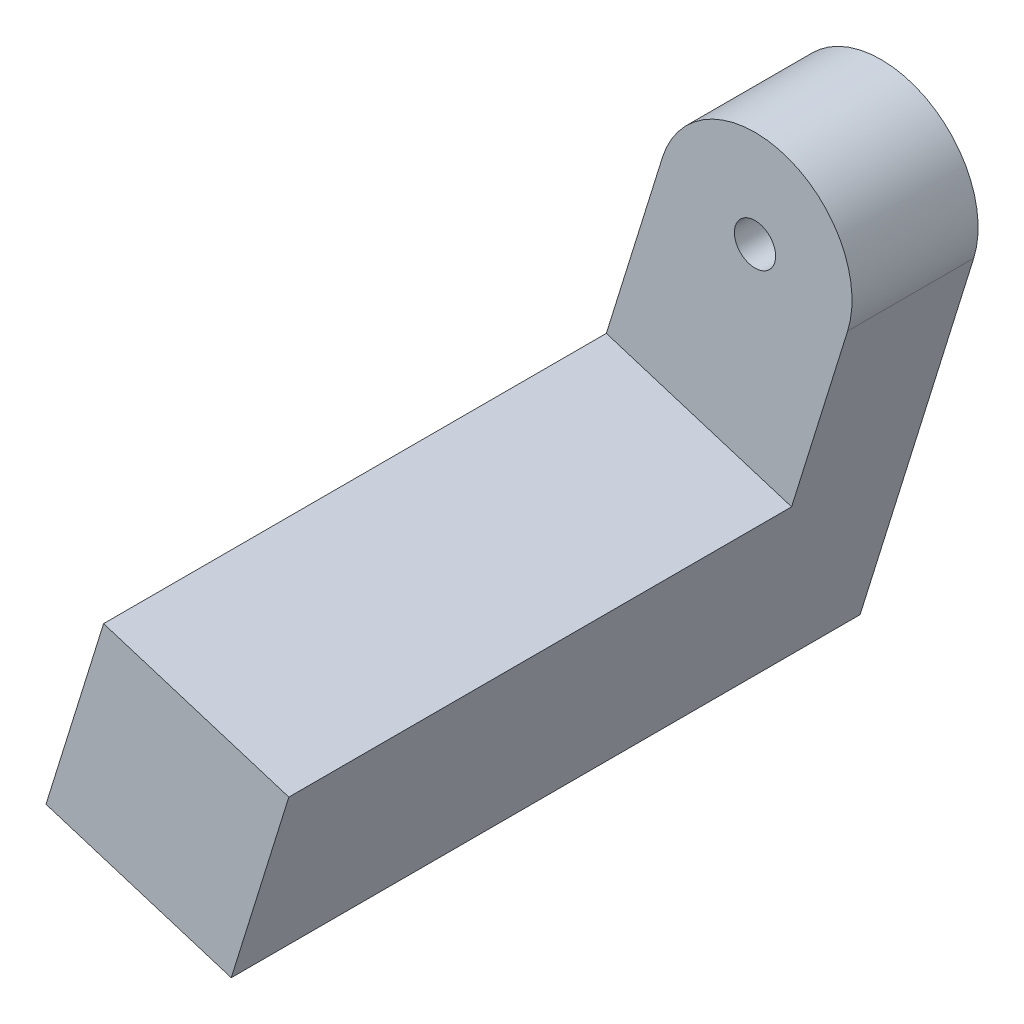
ISO-10303-21;
HEADER;
FILE_DESCRIPTION(('STEP AP214'),'2;1');
FILE_NAME('part.step','',(''),(''),'','','');
FILE_SCHEMA(('AUTOMOTIVE_DESIGN { 1 0 10303 214 1 1 1 1 }'));
ENDSEC;
DATA;
#1=APPLICATION_CONTEXT('core data for automotive mechanical design processes');
#2=APPLICATION_PROTOCOL_DEFINITION('international standard','automotive_design',2000,#1);
#3=PRODUCT_CONTEXT('',#1,'mechanical');
#4=PRODUCT('Part','Part','',(#3));
#5=PRODUCT_RELATED_PRODUCT_CATEGORY('part','',(#4));
#6=PRODUCT_DEFINITION_FORMATION('','',#4);
#7=PRODUCT_DEFINITION_CONTEXT('part definition',#1,'design');
#8=PRODUCT_DEFINITION('design','',#6,#7);
#9=PRODUCT_DEFINITION_SHAPE('','',#8);
#10=(LENGTH_UNIT() NAMED_UNIT(*) SI_UNIT(.MILLI.,.METRE.));
#11=(NAMED_UNIT(*) PLANE_ANGLE_UNIT() SI_UNIT($,.RADIAN.));
#12=(NAMED_UNIT(*) SI_UNIT($,.STERADIAN.) SOLID_ANGLE_UNIT());
#13=UNCERTAINTY_MEASURE_WITH_UNIT(LENGTH_MEASURE(1.E-05),#10,'distance_accuracy_value','');
#14=(GEOMETRIC_REPRESENTATION_CONTEXT(3) GLOBAL_UNCERTAINTY_ASSIGNED_CONTEXT((#13)) GLOBAL_UNIT_ASSIGNED_CONTEXT((#10,
#11,#12)) REPRESENTATION_CONTEXT('',''));
#15=CARTESIAN_POINT('',(0.,0.,0.));
#16=DIRECTION('',(0.,0.,1.));
#17=DIRECTION('',(1.,0.,0.));
#18=AXIS2_PLACEMENT_3D('',#15,#16,#17);
#19=CARTESIAN_POINT('',(-3.81965194648471,1.18754326561838,2.));
#20=DIRECTION('',(0.296885816404479,0.954912986621214,0.));
#21=DIRECTION('',(-0.954912986621214,0.296885816404479,0.));
#22=AXIS2_PLACEMENT_3D('',#19,#20,#21);
#23=PLANE('',#22);
#24=DIRECTION('',(0.,0.,1.));
#25=VECTOR('',#24,1.);
#26=CARTESIAN_POINT('',(-0.811676038627886,0.252352943944275,-3.19999999999843));
#27=LINE('',#26,#25);
#28=CARTESIAN_POINT('',(-0.811676038627886,0.252352943944275,-3.19999999999843));
#29=VERTEX_POINT('',#28);
#30=CARTESIAN_POINT('',(-0.811676038627886,0.252352943944275,0.));
#31=VERTEX_POINT('',#30);
#32=EDGE_CURVE('E11',#29,#31,#27,.T.);
#33=ORIENTED_EDGE('',*,*,#32,.F.);
#34=DIRECTION('',(0.954912986621214,-0.296885816404479,0.));
#35=VECTOR('',#34,1.);
#36=CARTESIAN_POINT('',(-3.81965194648471,1.18754326561838,-3.19999999999755));
#37=LINE('',#36,#35);
#38=CARTESIAN_POINT('',(-2.19629986920415,0.68283737772315,-3.19999999999804));
#39=VERTEX_POINT('',#38);
#40=EDGE_CURVE('E126',#39,#29,#37,.T.);
#41=ORIENTED_EDGE('',*,*,#40,.F.);
#42=DIRECTION('',(0.,0.,1.));
#43=VECTOR('',#42,1.);
#44=CARTESIAN_POINT('',(-2.19629986922865,0.682837377730769,-14.5137084989829));
#45=LINE('',#44,#43);
#46=CARTESIAN_POINT('',(-2.19629986922879,0.6828373777303,0.));
#47=VERTEX_POINT('',#46);
#48=EDGE_CURVE('E61',#47,#39,#45,.F.);
#49=ORIENTED_EDGE('',*,*,#48,.F.);
#50=DIRECTION('',(-0.954912986621214,0.296885816404479,0.));
#51=VECTOR('',#50,1.);
#52=CARTESIAN_POINT('',(0.,0.,0.));
#53=LINE('',#52,#51);
#54=EDGE_CURVE('E127',#31,#47,#53,.T.);
#55=ORIENTED_EDGE('',*,*,#54,.F.);
#56=EDGE_LOOP('',(#33,#41,#49,#55));
#57=FACE_BOUND('',#56,.T.);
#58=ADVANCED_FACE('F39',(#57),#23,.T.);
#59=CARTESIAN_POINT('',(0.,0.,-14.5137084989829));
#60=DIRECTION('',(0.,0.,1.));
#61=DIRECTION('',(1.,0.,0.));
#62=AXIS2_PLACEMENT_3D('',#59,#60,#61);
#63=CYLINDRICAL_SURFACE('',#62,4.);
#64=DIRECTION('',(0.,0.,1.));
#65=VECTOR('',#64,1.);
#66=CARTESIAN_POINT('',(-3.81965194648471,1.18754326561838,2.));
#67=LINE('',#66,#65);
#68=CARTESIAN_POINT('',(-3.81965194648471,1.18754326561838,-3.19999999999755));
#69=VERTEX_POINT('',#68);
#70=CARTESIAN_POINT('',(-3.81965194648471,1.18754326561838,2.));
#71=VERTEX_POINT('',#70);
#72=EDGE_CURVE('E145',#69,#71,#67,.T.);
#73=ORIENTED_EDGE('',*,*,#72,.T.);
#74=CARTESIAN_POINT('',(0.,0.,2.));
#75=DIRECTION('',(0.,0.,1.));
#76=DIRECTION('',(1.,0.,0.));
#77=AXIS2_PLACEMENT_3D('',#74,#75,#76);
#78=CIRCLE('',#77,4.);
#79=CARTESIAN_POINT('',(3.819651946485,-1.18754326561745,2.));
#80=VERTEX_POINT('',#79);
#81=EDGE_CURVE('E154',#80,#71,#78,.T.);
#82=ORIENTED_EDGE('',*,*,#81,.F.);
#83=DIRECTION('',(0.,0.,1.));
#84=VECTOR('',#83,1.);
#85=CARTESIAN_POINT('',(3.819651946485,-1.18754326561745,2.));
#86=LINE('',#85,#84);
#87=CARTESIAN_POINT('',(3.81965194648486,-1.18754326561791,-3.19999999999843));
#88=VERTEX_POINT('',#87);
#89=EDGE_CURVE('E137',#88,#80,#86,.T.);
#90=ORIENTED_EDGE('',*,*,#89,.F.);
#91=CARTESIAN_POINT('',(0.,0.,-3.19999999999819));
#92=DIRECTION('',(1.0538286023532E-13,1.33842857646129E-13,1.));
#93=DIRECTION('',(0.,-1.,1.33842857646129E-13));
#94=AXIS2_PLACEMENT_3D('',#91,#92,#93);
#95=CIRCLE('',#94,4.);
#96=EDGE_CURVE('E161',#69,#88,#95,.F.);
#97=ORIENTED_EDGE('',*,*,#96,.F.);
#98=EDGE_LOOP('',(#73,#82,#90,#97));
#99=FACE_BOUND('',#98,.T.);
#100=ADVANCED_FACE('F41',(#99),#63,.T.);
#101=CARTESIAN_POINT('',(0.,0.,-14.5137084989829));
#102=DIRECTION('',(0.,0.,1.));
#103=DIRECTION('',(1.,0.,0.));
#104=AXIS2_PLACEMENT_3D('',#101,#102,#103);
#105=CYLINDRICAL_SURFACE('',#104,2.3);
#106=CARTESIAN_POINT('',(0.,0.,0.));
#107=DIRECTION('',(0.,0.,1.));
#108=DIRECTION('',(1.,0.,0.));
#109=AXIS2_PLACEMENT_3D('',#106,#107,#108);
#110=CIRCLE('',#109,2.3);
#111=CARTESIAN_POINT('',(2.19629986922879,-0.6828373777303,0.));
#112=VERTEX_POINT('',#111);
#113=EDGE_CURVE('E158',#112,#47,#110,.T.);
#114=ORIENTED_EDGE('',*,*,#113,.T.);
#115=ORIENTED_EDGE('',*,*,#48,.T.);
#116=CARTESIAN_POINT('',(4.53526105559376E-11,5.94515756069391E-11,-3.19999999999818));
#117=DIRECTION('',(1.0538286023532E-13,1.33842857646129E-13,1.));
#118=DIRECTION('',(-0.954912986621214,0.296885816404478,0.));
#119=AXIS2_PLACEMENT_3D('',#116,#117,#118);
#120=CIRCLE('',#119,2.3);
#121=CARTESIAN_POINT('',(2.19629986925344,-0.682837377737451,-3.19999999999832));
#122=VERTEX_POINT('',#121);
#123=EDGE_CURVE('E130',#122,#39,#120,.T.);
#124=ORIENTED_EDGE('',*,*,#123,.F.);
#125=DIRECTION('',(0.,0.,1.));
#126=VECTOR('',#125,1.);
#127=CARTESIAN_POINT('',(2.19629986922894,-0.682837377729831,-14.5137084989829));
#128=LINE('',#127,#126);
#129=EDGE_CURVE('E148',#122,#112,#128,.T.);
#130=ORIENTED_EDGE('',*,*,#129,.T.);
#131=EDGE_LOOP('',(#114,#115,#124,#130));
#132=FACE_BOUND('',#131,.T.);
#133=ADVANCED_FACE('F165',(#132),#105,.F.);
#134=CARTESIAN_POINT('',(-2.61259518431406,-8.40323428220723,-3.19999999999679));
#135=DIRECTION('',(1.0538286023532E-13,1.33842857646129E-13,1.));
#136=DIRECTION('',(-0.954912986621214,0.296885816404478,0.));
#137=AXIS2_PLACEMENT_3D('',#134,#135,#136);
#138=PLANE('',#137);
#139=ORIENTED_EDGE('',*,*,#40,.T.);
#140=CARTESIAN_POINT('',(0.,0.,-3.19999999999843));
#141=DIRECTION('',(0.,0.,1.));
#142=DIRECTION('',(1.,0.,0.));
#143=AXIS2_PLACEMENT_3D('',#140,#141,#142);
#144=CIRCLE('',#143,0.85);
#145=CARTESIAN_POINT('',(0.811676038628177,-0.252352943943339,-3.19999999999843));
#146=VERTEX_POINT('',#145);
#147=EDGE_CURVE('E115',#29,#146,#144,.T.);
#148=ORIENTED_EDGE('',*,*,#147,.T.);
#149=EDGE_CURVE('E54',#146,#122,#37,.T.);
#150=ORIENTED_EDGE('',*,*,#149,.T.);
#151=ORIENTED_EDGE('',*,*,#123,.T.);
#152=EDGE_LOOP('',(#139,#148,#150,#151));
#153=FACE_BOUND('',#152,.T.);
#154=ORIENTED_EDGE('',*,*,#96,.T.);
#155=DIRECTION('',(0.296885816404479,0.954912986621214,0.));
#156=VECTOR('',#155,1.);
#157=CARTESIAN_POINT('',(3.819651946485,-1.18754326561745,-3.19999999999755));
#158=LINE('',#157,#156);
#159=CARTESIAN_POINT('',(-0.866666154954968,-16.260765923066,-3.19999999999755));
#160=VERTEX_POINT('',#159);
#161=EDGE_CURVE('E217',#160,#88,#158,.T.);
#162=ORIENTED_EDGE('',*,*,#161,.F.);
#163=DIRECTION('',(0.954912986621214,-0.296885816404479,0.));
#164=VECTOR('',#163,1.);
#165=CARTESIAN_POINT('',(-8.50597004792468,-13.8856793918302,-3.19999999999755));
#166=LINE('',#165,#164);
#167=CARTESIAN_POINT('',(-8.50597004792468,-13.8856793918302,-3.19999999999755));
#168=VERTEX_POINT('',#167);
#169=EDGE_CURVE('E134',#168,#160,#166,.T.);
#170=ORIENTED_EDGE('',*,*,#169,.F.);
#171=DIRECTION('',(0.296885816404479,0.954912986621214,0.));
#172=VECTOR('',#171,1.);
#173=CARTESIAN_POINT('',(-3.81965194648471,1.18754326561838,-3.19999999999755));
#174=LINE('',#173,#172);
#175=EDGE_CURVE('E202',#168,#69,#174,.T.);
#176=ORIENTED_EDGE('',*,*,#175,.T.);
#177=EDGE_LOOP('',(#154,#162,#170,#176));
#178=FACE_BOUND('',#177,.T.);
#179=ADVANCED_FACE('F128',(#153,#178),#138,.F.);
#180=CARTESIAN_POINT('',(0.,0.,0.));
#181=DIRECTION('',(0.,0.,1.));
#182=DIRECTION('',(1.,0.,0.));
#183=AXIS2_PLACEMENT_3D('',#180,#181,#182);
#184=PLANE('',#183);
#185=ORIENTED_EDGE('',*,*,#113,.F.);
#186=CARTESIAN_POINT('',(0.811676038628177,-0.252352943943339,0.));
#187=VERTEX_POINT('',#186);
#188=EDGE_CURVE('E133',#112,#187,#53,.T.);
#189=ORIENTED_EDGE('',*,*,#188,.T.);
#190=CARTESIAN_POINT('',(0.,0.,0.));
#191=DIRECTION('',(0.,0.,1.));
#192=DIRECTION('',(1.,0.,0.));
#193=AXIS2_PLACEMENT_3D('',#190,#191,#192);
#194=CIRCLE('',#193,0.85);
#195=EDGE_CURVE('E150',#187,#31,#194,.T.);
#196=ORIENTED_EDGE('',*,*,#195,.T.);
#197=ORIENTED_EDGE('',*,*,#54,.T.);
#198=EDGE_LOOP('',(#185,#189,#196,#197));
#199=FACE_BOUND('',#198,.T.);
#200=ADVANCED_FACE('F170',(#199),#184,.F.);
#201=CARTESIAN_POINT('',(0.,0.,2.));
#202=DIRECTION('',(0.,0.,1.));
#203=DIRECTION('',(1.,0.,0.));
#204=AXIS2_PLACEMENT_3D('',#201,#202,#203);
#205=PLANE('',#204);
#206=CARTESIAN_POINT('',(0.,0.,2.));
#207=DIRECTION('',(0.,0.,1.));
#208=DIRECTION('',(1.,0.,0.));
#209=AXIS2_PLACEMENT_3D('',#206,#207,#208);
#210=CIRCLE('',#209,0.85);
#211=CARTESIAN_POINT('',(0.85,0.,2.));
#212=VERTEX_POINT('',#211);
#213=EDGE_CURVE('E151',#212,#212,#210,.T.);
#214=ORIENTED_EDGE('',*,*,#213,.F.);
#215=EDGE_LOOP('',(#214));
#216=FACE_BOUND('',#215,.T.);
#217=ORIENTED_EDGE('',*,*,#81,.T.);
#218=DIRECTION('',(-0.296885816404479,-0.954912986621214,0.));
#219=VECTOR('',#218,1.);
#220=CARTESIAN_POINT('',(-3.81965194648471,1.18754326561838,2.));
#221=LINE('',#220,#219);
#222=CARTESIAN_POINT('',(-6.13088351668885,-6.24637549886046,2.));
#223=VERTEX_POINT('',#222);
#224=EDGE_CURVE('E206',#71,#223,#221,.T.);
#225=ORIENTED_EDGE('',*,*,#224,.T.);
#226=DIRECTION('',(0.954912986621214,-0.296885816404479,0.));
#227=VECTOR('',#226,1.);
#228=CARTESIAN_POINT('',(-6.13088351668885,-6.24637549886046,2.));
#229=LINE('',#228,#227);
#230=CARTESIAN_POINT('',(1.50842037628086,-8.62146203009629,2.));
#231=VERTEX_POINT('',#230);
#232=EDGE_CURVE('E144',#223,#231,#229,.T.);
#233=ORIENTED_EDGE('',*,*,#232,.T.);
#234=DIRECTION('',(-0.296885816404479,-0.954912986621214,0.));
#235=VECTOR('',#234,1.);
#236=CARTESIAN_POINT('',(3.819651946485,-1.18754326561745,2.));
#237=LINE('',#236,#235);
#238=EDGE_CURVE('E121',#80,#231,#237,.T.);
#239=ORIENTED_EDGE('',*,*,#238,.F.);
#240=EDGE_LOOP('',(#217,#225,#233,#239));
#241=FACE_BOUND('',#240,.T.);
#242=ADVANCED_FACE('F183',(#216,#241),#205,.T.);
#243=CARTESIAN_POINT('',(0.,0.,2.));
#244=DIRECTION('',(0.,0.,-1.));
#245=DIRECTION('',(-1.,0.,0.));
#246=AXIS2_PLACEMENT_3D('',#243,#244,#245);
#247=CYLINDRICAL_SURFACE('',#246,0.85);
#248=ORIENTED_EDGE('',*,*,#213,.T.);
#249=EDGE_LOOP('',(#248));
#250=FACE_BOUND('',#249,.T.);
#251=ORIENTED_EDGE('',*,*,#195,.F.);
#252=DIRECTION('',(0.,0.,1.));
#253=VECTOR('',#252,1.);
#254=CARTESIAN_POINT('',(0.811676038628177,-0.252352943943339,-3.19999999999843));
#255=LINE('',#254,#253);
#256=EDGE_CURVE('E47',#187,#146,#255,.F.);
#257=ORIENTED_EDGE('',*,*,#256,.T.);
#258=ORIENTED_EDGE('',*,*,#147,.F.);
#259=ORIENTED_EDGE('',*,*,#32,.T.);
#260=EDGE_LOOP('',(#251,#257,#258,#259));
#261=FACE_BOUND('',#260,.T.);
#262=ADVANCED_FACE('F118',(#250,#261),#247,.F.);
#263=ORIENTED_EDGE('',*,*,#256,.F.);
#264=ORIENTED_EDGE('',*,*,#188,.F.);
#265=ORIENTED_EDGE('',*,*,#129,.F.);
#266=ORIENTED_EDGE('',*,*,#149,.F.);
#267=EDGE_LOOP('',(#263,#264,#265,#266));
#268=FACE_BOUND('',#267,.T.);
#269=ADVANCED_FACE('F172',(#268),#23,.T.);
#270=CARTESIAN_POINT('',(-8.50597004792468,-13.8856793918302,22.7319132116981));
#271=DIRECTION('',(-0.296885816404479,-0.954912986621214,0.));
#272=DIRECTION('',(0.954912986621214,-0.296885816404479,0.));
#273=AXIS2_PLACEMENT_3D('',#270,#271,#272);
#274=PLANE('',#273);
#275=DIRECTION('',(0.,0.,-1.));
#276=VECTOR('',#275,1.);
#277=CARTESIAN_POINT('',(-0.866666154954968,-16.260765923066,22.7319132116981));
#278=LINE('',#277,#276);
#279=CARTESIAN_POINT('',(-0.866666154954968,-16.260765923066,22.7319132116981));
#280=VERTEX_POINT('',#279);
#281=EDGE_CURVE('E220',#280,#160,#278,.T.);
#282=ORIENTED_EDGE('',*,*,#281,.F.);
#283=DIRECTION('',(0.954912986621214,-0.296885816404479,0.));
#284=VECTOR('',#283,1.);
#285=CARTESIAN_POINT('',(-8.50597004792468,-13.8856793918302,22.7319132116981));
#286=LINE('',#285,#284);
#287=CARTESIAN_POINT('',(-8.50597004792468,-13.8856793918302,22.7319132116981));
#288=VERTEX_POINT('',#287);
#289=EDGE_CURVE('E140',#288,#280,#286,.T.);
#290=ORIENTED_EDGE('',*,*,#289,.F.);
#291=DIRECTION('',(0.,0.,-1.));
#292=VECTOR('',#291,1.);
#293=CARTESIAN_POINT('',(-8.50597004792468,-13.8856793918302,22.7319132116981));
#294=LINE('',#293,#292);
#295=EDGE_CURVE('E228',#288,#168,#294,.T.);
#296=ORIENTED_EDGE('',*,*,#295,.T.);
#297=ORIENTED_EDGE('',*,*,#169,.T.);
#298=EDGE_LOOP('',(#282,#290,#296,#297));
#299=FACE_BOUND('',#298,.T.);
#300=ADVANCED_FACE('F174',(#299),#274,.T.);
#301=CARTESIAN_POINT('',(-6.13088351668885,-6.24637549886046,22.7319132116981));
#302=DIRECTION('',(0.,0.,1.));
#303=DIRECTION('',(1.,0.,0.));
#304=AXIS2_PLACEMENT_3D('',#301,#302,#303);
#305=PLANE('',#304);
#306=DIRECTION('',(-0.296885816404479,-0.954912986621214,0.));
#307=VECTOR('',#306,1.);
#308=CARTESIAN_POINT('',(1.50842037628086,-8.62146203009629,22.7319132116981));
#309=LINE('',#308,#307);
#310=CARTESIAN_POINT('',(1.50842037628086,-8.62146203009629,22.7319132116981));
#311=VERTEX_POINT('',#310);
#312=EDGE_CURVE('E221',#311,#280,#309,.T.);
#313=ORIENTED_EDGE('',*,*,#312,.F.);
#314=DIRECTION('',(0.954912986621214,-0.296885816404479,0.));
#315=VECTOR('',#314,1.);
#316=CARTESIAN_POINT('',(-6.13088351668885,-6.24637549886046,22.7319132116981));
#317=LINE('',#316,#315);
#318=CARTESIAN_POINT('',(-6.13088351668885,-6.24637549886046,22.7319132116981));
#319=VERTEX_POINT('',#318);
#320=EDGE_CURVE('E142',#319,#311,#317,.T.);
#321=ORIENTED_EDGE('',*,*,#320,.F.);
#322=DIRECTION('',(-0.296885816404479,-0.954912986621214,0.));
#323=VECTOR('',#322,1.);
#324=CARTESIAN_POINT('',(-6.13088351668885,-6.24637549886046,22.7319132116981));
#325=LINE('',#324,#323);
#326=EDGE_CURVE('E231',#319,#288,#325,.T.);
#327=ORIENTED_EDGE('',*,*,#326,.T.);
#328=ORIENTED_EDGE('',*,*,#289,.T.);
#329=EDGE_LOOP('',(#313,#321,#327,#328));
#330=FACE_BOUND('',#329,.T.);
#331=ADVANCED_FACE('F180',(#330),#305,.T.);
#332=CARTESIAN_POINT('',(-6.13088351668885,-6.24637549886046,22.7319132116981));
#333=DIRECTION('',(0.296885816404479,0.954912986621214,0.));
#334=DIRECTION('',(-0.954912986621214,0.296885816404479,0.));
#335=AXIS2_PLACEMENT_3D('',#332,#333,#334);
#336=PLANE('',#335);
#337=DIRECTION('',(0.,0.,1.));
#338=VECTOR('',#337,1.);
#339=CARTESIAN_POINT('',(1.50842037628086,-8.62146203009629,22.7319132116981));
#340=LINE('',#339,#338);
#341=EDGE_CURVE('E212',#231,#311,#340,.T.);
#342=ORIENTED_EDGE('',*,*,#341,.F.);
#343=ORIENTED_EDGE('',*,*,#232,.F.);
#344=DIRECTION('',(0.,0.,1.));
#345=VECTOR('',#344,1.);
#346=CARTESIAN_POINT('',(-6.13088351668885,-6.24637549886046,22.7319132116981));
#347=LINE('',#346,#345);
#348=EDGE_CURVE('E218',#223,#319,#347,.T.);
#349=ORIENTED_EDGE('',*,*,#348,.T.);
#350=ORIENTED_EDGE('',*,*,#320,.T.);
#351=EDGE_LOOP('',(#342,#343,#349,#350));
#352=FACE_BOUND('',#351,.T.);
#353=ADVANCED_FACE('F237',(#352),#336,.T.);
#354=CARTESIAN_POINT('',(-3.81965194648485,1.18754326561791,0.));
#355=DIRECTION('',(0.954912986621214,-0.296885816404479,0.));
#356=DIRECTION('',(0.296885816404479,0.954912986621214,0.));
#357=AXIS2_PLACEMENT_3D('',#354,#355,#356);
#358=PLANE('',#357);
#359=ORIENTED_EDGE('',*,*,#224,.F.);
#360=ORIENTED_EDGE('',*,*,#72,.F.);
#361=ORIENTED_EDGE('',*,*,#175,.F.);
#362=ORIENTED_EDGE('',*,*,#295,.F.);
#363=ORIENTED_EDGE('',*,*,#326,.F.);
#364=ORIENTED_EDGE('',*,*,#348,.F.);
#365=EDGE_LOOP('',(#359,#360,#361,#362,#363,#364));
#366=FACE_BOUND('',#365,.T.);
#367=ADVANCED_FACE('F240',(#366),#358,.F.);
#368=CARTESIAN_POINT('',(3.81965194648486,-1.18754326561791,0.));
#369=DIRECTION('',(0.954912986621214,-0.296885816404479,0.));
#370=DIRECTION('',(0.296885816404479,0.954912986621214,0.));
#371=AXIS2_PLACEMENT_3D('',#368,#369,#370);
#372=PLANE('',#371);
#373=ORIENTED_EDGE('',*,*,#238,.T.);
#374=ORIENTED_EDGE('',*,*,#341,.T.);
#375=ORIENTED_EDGE('',*,*,#312,.T.);
#376=ORIENTED_EDGE('',*,*,#281,.T.);
#377=ORIENTED_EDGE('',*,*,#161,.T.);
#378=ORIENTED_EDGE('',*,*,#89,.T.);
#379=EDGE_LOOP('',(#373,#374,#375,#376,#377,#378));
#380=FACE_BOUND('',#379,.T.);
#381=ADVANCED_FACE('F214',(#380),#372,.T.);
#382=CLOSED_SHELL('',(#58,#100,#133,#179,#200,#242,#262,#269,#300,#331,#353,#367,#381));
#383=MANIFOLD_SOLID_BREP('B2',#382);
#384=ADVANCED_BREP_SHAPE_REPRESENTATION('',(#18,#383),#14);
#385=SHAPE_DEFINITION_REPRESENTATION(#9,#384);
ENDSEC;
END-ISO-10303-21;
